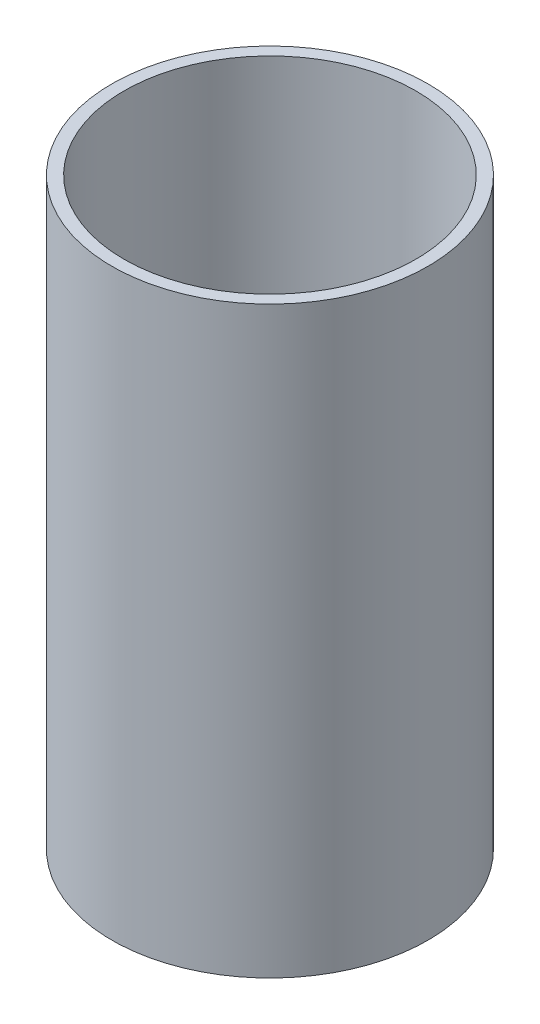
ISO-10303-21;
HEADER;
FILE_DESCRIPTION(('STEP AP214'),'2;1');
FILE_NAME('part.step','',(''),(''),'','','');
FILE_SCHEMA(('AUTOMOTIVE_DESIGN { 1 0 10303 214 1 1 1 1 }'));
ENDSEC;
DATA;
#1=APPLICATION_CONTEXT('core data for automotive mechanical design processes');
#2=APPLICATION_PROTOCOL_DEFINITION('international standard','automotive_design',2000,#1);
#3=PRODUCT_CONTEXT('',#1,'mechanical');
#4=PRODUCT('Part','Part','',(#3));
#5=PRODUCT_RELATED_PRODUCT_CATEGORY('part','',(#4));
#6=PRODUCT_DEFINITION_FORMATION('','',#4);
#7=PRODUCT_DEFINITION_CONTEXT('part definition',#1,'design');
#8=PRODUCT_DEFINITION('design','',#6,#7);
#9=PRODUCT_DEFINITION_SHAPE('','',#8);
#10=(LENGTH_UNIT() NAMED_UNIT(*) SI_UNIT(.MILLI.,.METRE.));
#11=(NAMED_UNIT(*) PLANE_ANGLE_UNIT() SI_UNIT($,.RADIAN.));
#12=(NAMED_UNIT(*) SI_UNIT($,.STERADIAN.) SOLID_ANGLE_UNIT());
#13=UNCERTAINTY_MEASURE_WITH_UNIT(LENGTH_MEASURE(1.E-05),#10,'distance_accuracy_value','');
#14=(GEOMETRIC_REPRESENTATION_CONTEXT(3) GLOBAL_UNCERTAINTY_ASSIGNED_CONTEXT((#13)) GLOBAL_UNIT_ASSIGNED_CONTEXT((#10,
#11,#12)) REPRESENTATION_CONTEXT('',''));
#15=CARTESIAN_POINT('',(0.,0.,0.));
#16=DIRECTION('',(0.,0.,1.));
#17=DIRECTION('',(1.,0.,0.));
#18=AXIS2_PLACEMENT_3D('',#15,#16,#17);
#19=CARTESIAN_POINT('',(-41.275,0.,0.));
#20=DIRECTION('',(0.,1.,0.));
#21=DIRECTION('',(0.,0.,1.));
#22=AXIS2_PLACEMENT_3D('',#19,#20,#21);
#23=PLANE('',#22);
#24=CARTESIAN_POINT('',(0.,0.,0.));
#25=DIRECTION('',(0.,-1.,0.));
#26=DIRECTION('',(0.,0.,-1.));
#27=AXIS2_PLACEMENT_3D('',#24,#25,#26);
#28=CIRCLE('',#27,38.1);
#29=CARTESIAN_POINT('',(0.,0.,-38.1));
#30=VERTEX_POINT('',#29);
#31=EDGE_CURVE('E10',#30,#30,#28,.T.);
#32=ORIENTED_EDGE('',*,*,#31,.F.);
#33=EDGE_LOOP('',(#32));
#34=FACE_BOUND('',#33,.T.);
#35=CARTESIAN_POINT('',(0.,0.,0.));
#36=DIRECTION('',(0.,-1.,0.));
#37=DIRECTION('',(0.,0.,-1.));
#38=AXIS2_PLACEMENT_3D('',#35,#36,#37);
#39=CIRCLE('',#38,41.275);
#40=CARTESIAN_POINT('',(0.,0.,-41.275));
#41=VERTEX_POINT('',#40);
#42=EDGE_CURVE('E54',#41,#41,#39,.T.);
#43=ORIENTED_EDGE('',*,*,#42,.T.);
#44=EDGE_LOOP('',(#43));
#45=FACE_BOUND('',#44,.T.);
#46=ADVANCED_FACE('F37',(#34,#45),#23,.F.);
#47=CARTESIAN_POINT('',(0.,0.,0.));
#48=DIRECTION('',(0.,-1.,0.));
#49=DIRECTION('',(0.,0.,-1.));
#50=AXIS2_PLACEMENT_3D('',#47,#48,#49);
#51=CYLINDRICAL_SURFACE('',#50,38.1);
#52=CARTESIAN_POINT('',(0.,152.4,0.));
#53=DIRECTION('',(0.,-1.,0.));
#54=DIRECTION('',(0.,0.,-1.));
#55=AXIS2_PLACEMENT_3D('',#52,#53,#54);
#56=CIRCLE('',#55,38.1);
#57=CARTESIAN_POINT('',(0.,152.4,-38.1));
#58=VERTEX_POINT('',#57);
#59=EDGE_CURVE('E44',#58,#58,#56,.T.);
#60=ORIENTED_EDGE('',*,*,#59,.F.);
#61=EDGE_LOOP('',(#60));
#62=FACE_BOUND('',#61,.T.);
#63=ORIENTED_EDGE('',*,*,#31,.T.);
#64=EDGE_LOOP('',(#63));
#65=FACE_BOUND('',#64,.T.);
#66=ADVANCED_FACE('F70',(#62,#65),#51,.F.);
#67=CARTESIAN_POINT('',(-38.1,152.4,0.));
#68=DIRECTION('',(0.,-1.,0.));
#69=DIRECTION('',(0.,0.,-1.));
#70=AXIS2_PLACEMENT_3D('',#67,#68,#69);
#71=PLANE('',#70);
#72=CARTESIAN_POINT('',(0.,152.4,0.));
#73=DIRECTION('',(0.,-1.,0.));
#74=DIRECTION('',(0.,0.,-1.));
#75=AXIS2_PLACEMENT_3D('',#72,#73,#74);
#76=CIRCLE('',#75,41.275);
#77=CARTESIAN_POINT('',(0.,152.4,-41.275));
#78=VERTEX_POINT('',#77);
#79=EDGE_CURVE('E49',#78,#78,#76,.T.);
#80=ORIENTED_EDGE('',*,*,#79,.F.);
#81=EDGE_LOOP('',(#80));
#82=FACE_BOUND('',#81,.T.);
#83=ORIENTED_EDGE('',*,*,#59,.T.);
#84=EDGE_LOOP('',(#83));
#85=FACE_BOUND('',#84,.T.);
#86=ADVANCED_FACE('F65',(#82,#85),#71,.F.);
#87=CARTESIAN_POINT('',(0.,0.,0.));
#88=DIRECTION('',(0.,-1.,0.));
#89=DIRECTION('',(0.,0.,-1.));
#90=AXIS2_PLACEMENT_3D('',#87,#88,#89);
#91=CYLINDRICAL_SURFACE('',#90,41.275);
#92=ORIENTED_EDGE('',*,*,#42,.F.);
#93=EDGE_LOOP('',(#92));
#94=FACE_BOUND('',#93,.T.);
#95=ORIENTED_EDGE('',*,*,#79,.T.);
#96=EDGE_LOOP('',(#95));
#97=FACE_BOUND('',#96,.T.);
#98=ADVANCED_FACE('F62',(#94,#97),#91,.T.);
#99=CLOSED_SHELL('',(#46,#66,#86,#98));
#100=MANIFOLD_SOLID_BREP('B2',#99);
#101=ADVANCED_BREP_SHAPE_REPRESENTATION('',(#18,#100),#14);
#102=SHAPE_DEFINITION_REPRESENTATION(#9,#101);
ENDSEC;
END-ISO-10303-21;
